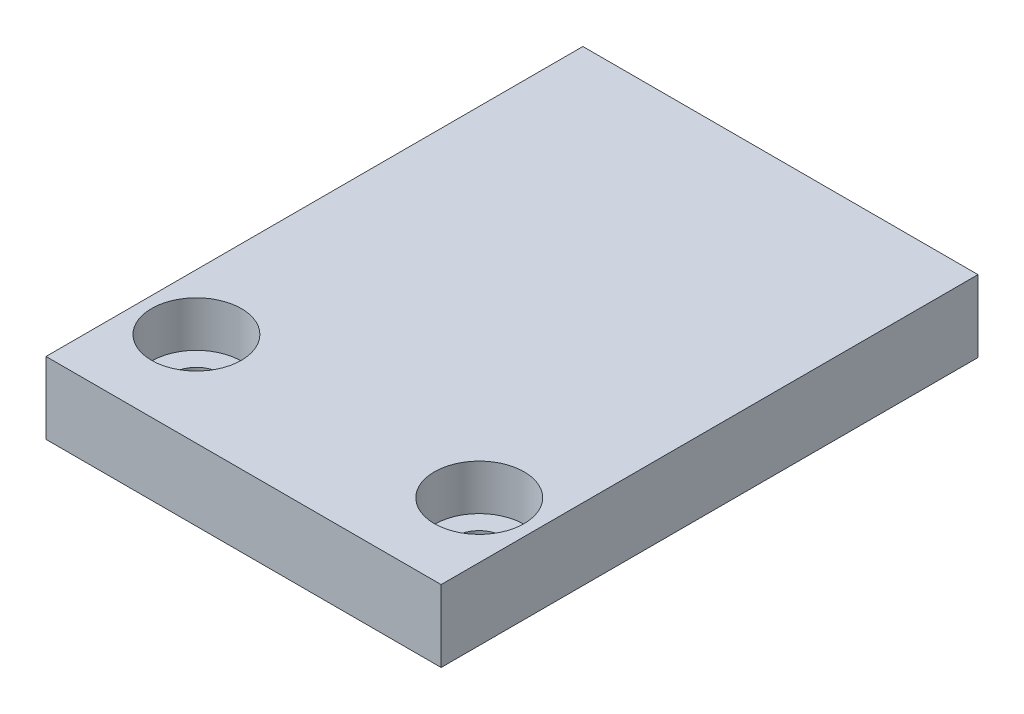
ISO-10303-21;
HEADER;
FILE_DESCRIPTION(('STEP AP214'),'2;1');
FILE_NAME('part.step','',(''),(''),'','','');
FILE_SCHEMA(('AUTOMOTIVE_DESIGN { 1 0 10303 214 1 1 1 1 }'));
ENDSEC;
DATA;
#1=APPLICATION_CONTEXT('core data for automotive mechanical design processes');
#2=APPLICATION_PROTOCOL_DEFINITION('international standard','automotive_design',2000,#1);
#3=PRODUCT_CONTEXT('',#1,'mechanical');
#4=PRODUCT('Part','Part','',(#3));
#5=PRODUCT_RELATED_PRODUCT_CATEGORY('part','',(#4));
#6=PRODUCT_DEFINITION_FORMATION('','',#4);
#7=PRODUCT_DEFINITION_CONTEXT('part definition',#1,'design');
#8=PRODUCT_DEFINITION('design','',#6,#7);
#9=PRODUCT_DEFINITION_SHAPE('','',#8);
#10=(LENGTH_UNIT() NAMED_UNIT(*) SI_UNIT(.MILLI.,.METRE.));
#11=(NAMED_UNIT(*) PLANE_ANGLE_UNIT() SI_UNIT($,.RADIAN.));
#12=(NAMED_UNIT(*) SI_UNIT($,.STERADIAN.) SOLID_ANGLE_UNIT());
#13=UNCERTAINTY_MEASURE_WITH_UNIT(LENGTH_MEASURE(1.E-05),#10,'distance_accuracy_value','');
#14=(GEOMETRIC_REPRESENTATION_CONTEXT(3) GLOBAL_UNCERTAINTY_ASSIGNED_CONTEXT((#13)) GLOBAL_UNIT_ASSIGNED_CONTEXT((#10,
#11,#12)) REPRESENTATION_CONTEXT('',''));
#15=CARTESIAN_POINT('',(0.,0.,0.));
#16=DIRECTION('',(0.,0.,1.));
#17=DIRECTION('',(1.,0.,0.));
#18=AXIS2_PLACEMENT_3D('',#15,#16,#17);
#19=CARTESIAN_POINT('',(20.955,7.62,28.473781));
#20=DIRECTION('',(-1.,0.,0.));
#21=DIRECTION('',(0.,0.,1.));
#22=AXIS2_PLACEMENT_3D('',#19,#20,#21);
#23=PLANE('',#22);
#24=DIRECTION('',(0.,0.,-1.));
#25=VECTOR('',#24,1.);
#26=CARTESIAN_POINT('',(20.955,0.,28.473781));
#27=LINE('',#26,#25);
#28=CARTESIAN_POINT('',(20.955,0.,28.473781));
#29=VERTEX_POINT('',#28);
#30=CARTESIAN_POINT('',(20.955,0.,-28.473781));
#31=VERTEX_POINT('',#30);
#32=EDGE_CURVE('E95',#29,#31,#27,.T.);
#33=ORIENTED_EDGE('',*,*,#32,.T.);
#34=DIRECTION('',(0.,-1.,0.));
#35=VECTOR('',#34,1.);
#36=CARTESIAN_POINT('',(20.955,7.62,-28.473781));
#37=LINE('',#36,#35);
#38=CARTESIAN_POINT('',(20.955,7.62,-28.473781));
#39=VERTEX_POINT('',#38);
#40=EDGE_CURVE('E11',#39,#31,#37,.T.);
#41=ORIENTED_EDGE('',*,*,#40,.F.);
#42=DIRECTION('',(0.,0.,-1.));
#43=VECTOR('',#42,1.);
#44=CARTESIAN_POINT('',(20.955,7.62,28.473781));
#45=LINE('',#44,#43);
#46=CARTESIAN_POINT('',(20.955,7.62,28.473781));
#47=VERTEX_POINT('',#46);
#48=EDGE_CURVE('E83',#47,#39,#45,.T.);
#49=ORIENTED_EDGE('',*,*,#48,.F.);
#50=DIRECTION('',(0.,-1.,0.));
#51=VECTOR('',#50,1.);
#52=CARTESIAN_POINT('',(20.955,7.62,28.473781));
#53=LINE('',#52,#51);
#54=EDGE_CURVE('E91',#47,#29,#53,.T.);
#55=ORIENTED_EDGE('',*,*,#54,.T.);
#56=EDGE_LOOP('',(#33,#41,#49,#55));
#57=FACE_BOUND('',#56,.T.);
#58=ADVANCED_FACE('F32',(#57),#23,.F.);
#59=CARTESIAN_POINT('',(-20.955,7.62,-28.473781));
#60=DIRECTION('',(0.,0.,1.));
#61=DIRECTION('',(1.,0.,0.));
#62=AXIS2_PLACEMENT_3D('',#59,#60,#61);
#63=PLANE('',#62);
#64=DIRECTION('',(-1.,0.,0.));
#65=VECTOR('',#64,1.);
#66=CARTESIAN_POINT('',(-20.955,0.,-28.473781));
#67=LINE('',#66,#65);
#68=CARTESIAN_POINT('',(-20.955,0.,-28.473781));
#69=VERTEX_POINT('',#68);
#70=EDGE_CURVE('E87',#31,#69,#67,.T.);
#71=ORIENTED_EDGE('',*,*,#70,.T.);
#72=DIRECTION('',(0.,-1.,0.));
#73=VECTOR('',#72,1.);
#74=CARTESIAN_POINT('',(-20.955,7.62,-28.473781));
#75=LINE('',#74,#73);
#76=CARTESIAN_POINT('',(-20.955,7.62,-28.473781));
#77=VERTEX_POINT('',#76);
#78=EDGE_CURVE('E40',#77,#69,#75,.T.);
#79=ORIENTED_EDGE('',*,*,#78,.F.);
#80=DIRECTION('',(-1.,0.,0.));
#81=VECTOR('',#80,1.);
#82=CARTESIAN_POINT('',(-20.955,7.62,-28.473781));
#83=LINE('',#82,#81);
#84=EDGE_CURVE('E78',#39,#77,#83,.T.);
#85=ORIENTED_EDGE('',*,*,#84,.F.);
#86=ORIENTED_EDGE('',*,*,#40,.T.);
#87=EDGE_LOOP('',(#71,#79,#85,#86));
#88=FACE_BOUND('',#87,.T.);
#89=ADVANCED_FACE('F86',(#88),#63,.F.);
#90=CARTESIAN_POINT('',(-20.955,7.62,28.473781));
#91=DIRECTION('',(1.,0.,0.));
#92=DIRECTION('',(0.,0.,-1.));
#93=AXIS2_PLACEMENT_3D('',#90,#91,#92);
#94=PLANE('',#93);
#95=DIRECTION('',(0.,0.,1.));
#96=VECTOR('',#95,1.);
#97=CARTESIAN_POINT('',(-20.955,0.,28.473781));
#98=LINE('',#97,#96);
#99=CARTESIAN_POINT('',(-20.955,0.,28.473781));
#100=VERTEX_POINT('',#99);
#101=EDGE_CURVE('E65',#69,#100,#98,.T.);
#102=ORIENTED_EDGE('',*,*,#101,.T.);
#103=DIRECTION('',(0.,-1.,0.));
#104=VECTOR('',#103,1.);
#105=CARTESIAN_POINT('',(-20.955,7.62,28.473781));
#106=LINE('',#105,#104);
#107=CARTESIAN_POINT('',(-20.955,7.62,28.473781));
#108=VERTEX_POINT('',#107);
#109=EDGE_CURVE('E88',#108,#100,#106,.T.);
#110=ORIENTED_EDGE('',*,*,#109,.F.);
#111=DIRECTION('',(0.,0.,1.));
#112=VECTOR('',#111,1.);
#113=CARTESIAN_POINT('',(-20.955,7.62,28.473781));
#114=LINE('',#113,#112);
#115=EDGE_CURVE('E81',#77,#108,#114,.T.);
#116=ORIENTED_EDGE('',*,*,#115,.F.);
#117=ORIENTED_EDGE('',*,*,#78,.T.);
#118=EDGE_LOOP('',(#102,#110,#116,#117));
#119=FACE_BOUND('',#118,.T.);
#120=ADVANCED_FACE('F89',(#119),#94,.F.);
#121=CARTESIAN_POINT('',(-20.955,7.62,28.473781));
#122=DIRECTION('',(0.,0.,-1.));
#123=DIRECTION('',(-1.,0.,0.));
#124=AXIS2_PLACEMENT_3D('',#121,#122,#123);
#125=PLANE('',#124);
#126=DIRECTION('',(1.,0.,0.));
#127=VECTOR('',#126,1.);
#128=CARTESIAN_POINT('',(-20.955,0.,28.473781));
#129=LINE('',#128,#127);
#130=EDGE_CURVE('E71',#100,#29,#129,.T.);
#131=ORIENTED_EDGE('',*,*,#130,.T.);
#132=ORIENTED_EDGE('',*,*,#54,.F.);
#133=DIRECTION('',(1.,0.,0.));
#134=VECTOR('',#133,1.);
#135=CARTESIAN_POINT('',(-20.955,7.62,28.473781));
#136=LINE('',#135,#134);
#137=EDGE_CURVE('E48',#108,#47,#136,.T.);
#138=ORIENTED_EDGE('',*,*,#137,.F.);
#139=ORIENTED_EDGE('',*,*,#109,.T.);
#140=EDGE_LOOP('',(#131,#132,#138,#139));
#141=FACE_BOUND('',#140,.T.);
#142=ADVANCED_FACE('F103',(#141),#125,.F.);
#143=CARTESIAN_POINT('',(0.,7.62,0.));
#144=DIRECTION('',(0.,-1.,0.));
#145=DIRECTION('',(0.,0.,-1.));
#146=AXIS2_PLACEMENT_3D('',#143,#144,#145);
#147=PLANE('',#146);
#148=CARTESIAN_POINT('',(-15.,7.62000000000002,18.473781));
#149=DIRECTION('',(0.,1.,0.));
#150=DIRECTION('',(0.,0.,1.));
#151=AXIS2_PLACEMENT_3D('',#148,#149,#150);
#152=CIRCLE('',#151,4.76249999999999);
#153=CARTESIAN_POINT('',(-15.,7.62000000000002,23.236281));
#154=VERTEX_POINT('',#153);
#155=EDGE_CURVE('E129',#154,#154,#152,.T.);
#156=ORIENTED_EDGE('',*,*,#155,.F.);
#157=EDGE_LOOP('',(#156));
#158=FACE_BOUND('',#157,.T.);
#159=CARTESIAN_POINT('',(15.,7.62000000000002,18.473781));
#160=DIRECTION('',(0.,1.,0.));
#161=DIRECTION('',(0.,0.,1.));
#162=AXIS2_PLACEMENT_3D('',#159,#160,#161);
#163=CIRCLE('',#162,4.76249999999999);
#164=CARTESIAN_POINT('',(15.,7.62000000000002,23.236281));
#165=VERTEX_POINT('',#164);
#166=EDGE_CURVE('E117',#165,#165,#163,.T.);
#167=ORIENTED_EDGE('',*,*,#166,.F.);
#168=EDGE_LOOP('',(#167));
#169=FACE_BOUND('',#168,.T.);
#170=ORIENTED_EDGE('',*,*,#48,.T.);
#171=ORIENTED_EDGE('',*,*,#84,.T.);
#172=ORIENTED_EDGE('',*,*,#115,.T.);
#173=ORIENTED_EDGE('',*,*,#137,.T.);
#174=EDGE_LOOP('',(#170,#171,#172,#173));
#175=FACE_BOUND('',#174,.T.);
#176=ADVANCED_FACE('F79',(#158,#169,#175),#147,.F.);
#177=CARTESIAN_POINT('',(0.,0.,0.));
#178=DIRECTION('',(0.,-1.,0.));
#179=DIRECTION('',(0.,0.,-1.));
#180=AXIS2_PLACEMENT_3D('',#177,#178,#179);
#181=PLANE('',#180);
#182=CARTESIAN_POINT('',(-15.,0.,18.473781));
#183=DIRECTION('',(0.,1.,0.));
#184=DIRECTION('',(0.,0.,1.));
#185=AXIS2_PLACEMENT_3D('',#182,#183,#184);
#186=CIRCLE('',#185,2.55270000000001);
#187=CARTESIAN_POINT('',(-15.,0.,21.026481));
#188=VERTEX_POINT('',#187);
#189=EDGE_CURVE('E120',#188,#188,#186,.T.);
#190=ORIENTED_EDGE('',*,*,#189,.T.);
#191=EDGE_LOOP('',(#190));
#192=FACE_BOUND('',#191,.T.);
#193=CARTESIAN_POINT('',(15.,0.,18.473781));
#194=DIRECTION('',(0.,1.,0.));
#195=DIRECTION('',(0.,0.,1.));
#196=AXIS2_PLACEMENT_3D('',#193,#194,#195);
#197=CIRCLE('',#196,2.55270000000001);
#198=CARTESIAN_POINT('',(15.,0.,21.026481));
#199=VERTEX_POINT('',#198);
#200=EDGE_CURVE('E98',#199,#199,#197,.T.);
#201=ORIENTED_EDGE('',*,*,#200,.T.);
#202=EDGE_LOOP('',(#201));
#203=FACE_BOUND('',#202,.T.);
#204=ORIENTED_EDGE('',*,*,#32,.F.);
#205=ORIENTED_EDGE('',*,*,#130,.F.);
#206=ORIENTED_EDGE('',*,*,#101,.F.);
#207=ORIENTED_EDGE('',*,*,#70,.F.);
#208=EDGE_LOOP('',(#204,#205,#206,#207));
#209=FACE_BOUND('',#208,.T.);
#210=ADVANCED_FACE('F106',(#192,#203,#209),#181,.T.);
#211=CARTESIAN_POINT('',(15.,7.62000000000002,18.473781));
#212=DIRECTION('',(0.,1.,0.));
#213=DIRECTION('',(0.,0.,1.));
#214=AXIS2_PLACEMENT_3D('',#211,#212,#213);
#215=CYLINDRICAL_SURFACE('',#214,2.55270000000001);
#216=ORIENTED_EDGE('',*,*,#200,.F.);
#217=EDGE_LOOP('',(#216));
#218=FACE_BOUND('',#217,.T.);
#219=CARTESIAN_POINT('',(15.,2.79400000000002,18.473781));
#220=DIRECTION('',(0.,1.,0.));
#221=DIRECTION('',(0.,0.,1.));
#222=AXIS2_PLACEMENT_3D('',#219,#220,#221);
#223=CIRCLE('',#222,2.55270000000001);
#224=CARTESIAN_POINT('',(15.,2.79400000000002,21.026481));
#225=VERTEX_POINT('',#224);
#226=EDGE_CURVE('E111',#225,#225,#223,.T.);
#227=ORIENTED_EDGE('',*,*,#226,.T.);
#228=EDGE_LOOP('',(#227));
#229=FACE_BOUND('',#228,.T.);
#230=ADVANCED_FACE('F153',(#218,#229),#215,.F.);
#231=CARTESIAN_POINT('',(17.5527,2.79400000000002,18.473781));
#232=DIRECTION('',(0.,-1.,0.));
#233=DIRECTION('',(0.,0.,-1.));
#234=AXIS2_PLACEMENT_3D('',#231,#232,#233);
#235=PLANE('',#234);
#236=ORIENTED_EDGE('',*,*,#226,.F.);
#237=EDGE_LOOP('',(#236));
#238=FACE_BOUND('',#237,.T.);
#239=CARTESIAN_POINT('',(15.,2.79400000000002,18.473781));
#240=DIRECTION('',(0.,1.,0.));
#241=DIRECTION('',(0.,0.,1.));
#242=AXIS2_PLACEMENT_3D('',#239,#240,#241);
#243=CIRCLE('',#242,4.7625);
#244=CARTESIAN_POINT('',(15.,2.79400000000002,23.236281));
#245=VERTEX_POINT('',#244);
#246=EDGE_CURVE('E114',#245,#245,#243,.T.);
#247=ORIENTED_EDGE('',*,*,#246,.T.);
#248=EDGE_LOOP('',(#247));
#249=FACE_BOUND('',#248,.T.);
#250=ADVANCED_FACE('F143',(#238,#249),#235,.F.);
#251=CARTESIAN_POINT('',(15.,7.62000000000002,18.473781));
#252=DIRECTION('',(0.,1.,0.));
#253=DIRECTION('',(0.,0.,1.));
#254=AXIS2_PLACEMENT_3D('',#251,#252,#253);
#255=CYLINDRICAL_SURFACE('',#254,4.76249999999999);
#256=ORIENTED_EDGE('',*,*,#246,.F.);
#257=EDGE_LOOP('',(#256));
#258=FACE_BOUND('',#257,.T.);
#259=ORIENTED_EDGE('',*,*,#166,.T.);
#260=EDGE_LOOP('',(#259));
#261=FACE_BOUND('',#260,.T.);
#262=ADVANCED_FACE('F140',(#258,#261),#255,.F.);
#263=CARTESIAN_POINT('',(-15.,7.62000000000002,18.473781));
#264=DIRECTION('',(0.,1.,0.));
#265=DIRECTION('',(0.,0.,1.));
#266=AXIS2_PLACEMENT_3D('',#263,#264,#265);
#267=CYLINDRICAL_SURFACE('',#266,2.55270000000001);
#268=ORIENTED_EDGE('',*,*,#189,.F.);
#269=EDGE_LOOP('',(#268));
#270=FACE_BOUND('',#269,.T.);
#271=CARTESIAN_POINT('',(-15.,2.79400000000002,18.473781));
#272=DIRECTION('',(0.,1.,0.));
#273=DIRECTION('',(0.,0.,1.));
#274=AXIS2_PLACEMENT_3D('',#271,#272,#273);
#275=CIRCLE('',#274,2.55270000000001);
#276=CARTESIAN_POINT('',(-15.,2.79400000000002,21.026481));
#277=VERTEX_POINT('',#276);
#278=EDGE_CURVE('E123',#277,#277,#275,.T.);
#279=ORIENTED_EDGE('',*,*,#278,.T.);
#280=EDGE_LOOP('',(#279));
#281=FACE_BOUND('',#280,.T.);
#282=ADVANCED_FACE('F142',(#270,#281),#267,.F.);
#283=CARTESIAN_POINT('',(-12.4473,2.79400000000002,18.473781));
#284=DIRECTION('',(0.,-1.,0.));
#285=DIRECTION('',(0.,0.,-1.));
#286=AXIS2_PLACEMENT_3D('',#283,#284,#285);
#287=PLANE('',#286);
#288=ORIENTED_EDGE('',*,*,#278,.F.);
#289=EDGE_LOOP('',(#288));
#290=FACE_BOUND('',#289,.T.);
#291=CARTESIAN_POINT('',(-15.,2.79400000000002,18.473781));
#292=DIRECTION('',(0.,1.,0.));
#293=DIRECTION('',(0.,0.,1.));
#294=AXIS2_PLACEMENT_3D('',#291,#292,#293);
#295=CIRCLE('',#294,4.7625);
#296=CARTESIAN_POINT('',(-15.,2.79400000000002,23.236281));
#297=VERTEX_POINT('',#296);
#298=EDGE_CURVE('E126',#297,#297,#295,.T.);
#299=ORIENTED_EDGE('',*,*,#298,.T.);
#300=EDGE_LOOP('',(#299));
#301=FACE_BOUND('',#300,.T.);
#302=ADVANCED_FACE('F150',(#290,#301),#287,.F.);
#303=CARTESIAN_POINT('',(-15.,7.62000000000002,18.473781));
#304=DIRECTION('',(0.,1.,0.));
#305=DIRECTION('',(0.,0.,1.));
#306=AXIS2_PLACEMENT_3D('',#303,#304,#305);
#307=CYLINDRICAL_SURFACE('',#306,4.76249999999999);
#308=ORIENTED_EDGE('',*,*,#298,.F.);
#309=EDGE_LOOP('',(#308));
#310=FACE_BOUND('',#309,.T.);
#311=ORIENTED_EDGE('',*,*,#155,.T.);
#312=EDGE_LOOP('',(#311));
#313=FACE_BOUND('',#312,.T.);
#314=ADVANCED_FACE('F133',(#310,#313),#307,.F.);
#315=CLOSED_SHELL('',(#58,#89,#120,#142,#176,#210,#230,#250,#262,#282,#302,#314));
#316=MANIFOLD_SOLID_BREP('B2',#315);
#317=ADVANCED_BREP_SHAPE_REPRESENTATION('',(#18,#316),#14);
#318=SHAPE_DEFINITION_REPRESENTATION(#9,#317);
ENDSEC;
END-ISO-10303-21;
